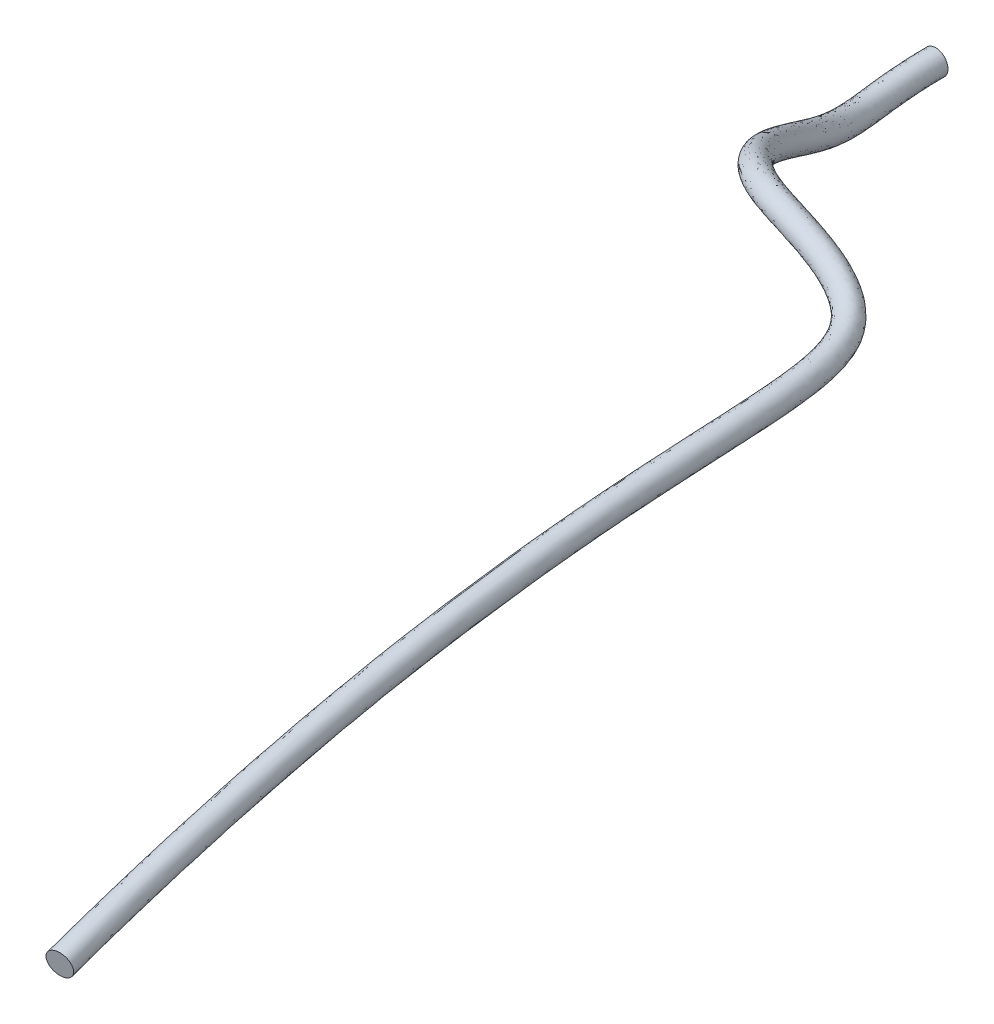
ISO-10303-21;
HEADER;
FILE_DESCRIPTION(('STEP AP214'),'2;1');
FILE_NAME('part.step','',(''),(''),'','','');
FILE_SCHEMA(('AUTOMOTIVE_DESIGN { 1 0 10303 214 1 1 1 1 }'));
ENDSEC;
DATA;
#1=APPLICATION_CONTEXT('core data for automotive mechanical design processes');
#2=APPLICATION_PROTOCOL_DEFINITION('international standard','automotive_design',2000,#1);
#3=PRODUCT_CONTEXT('',#1,'mechanical');
#4=PRODUCT('Part','Part','',(#3));
#5=PRODUCT_RELATED_PRODUCT_CATEGORY('part','',(#4));
#6=PRODUCT_DEFINITION_FORMATION('','',#4);
#7=PRODUCT_DEFINITION_CONTEXT('part definition',#1,'design');
#8=PRODUCT_DEFINITION('design','',#6,#7);
#9=PRODUCT_DEFINITION_SHAPE('','',#8);
#10=(LENGTH_UNIT() NAMED_UNIT(*) SI_UNIT(.MILLI.,.METRE.));
#11=(NAMED_UNIT(*) PLANE_ANGLE_UNIT() SI_UNIT($,.RADIAN.));
#12=(NAMED_UNIT(*) SI_UNIT($,.STERADIAN.) SOLID_ANGLE_UNIT());
#13=UNCERTAINTY_MEASURE_WITH_UNIT(LENGTH_MEASURE(1.E-05),#10,'distance_accuracy_value','');
#14=(GEOMETRIC_REPRESENTATION_CONTEXT(3) GLOBAL_UNCERTAINTY_ASSIGNED_CONTEXT((#13)) GLOBAL_UNIT_ASSIGNED_CONTEXT((#10,
#11,#12)) REPRESENTATION_CONTEXT('',''));
#15=CARTESIAN_POINT('',(0.,0.,0.));
#16=DIRECTION('',(0.,0.,1.));
#17=DIRECTION('',(1.,0.,0.));
#18=AXIS2_PLACEMENT_3D('',#15,#16,#17);
#19=CARTESIAN_POINT('',(0.,0.,0.));
#20=DIRECTION('',(0.,0.,1.));
#21=DIRECTION('',(-1.,0.,0.));
#22=AXIS2_PLACEMENT_3D('',#19,#20,#21);
#23=PLANE('',#22);
#24=CARTESIAN_POINT('',(0.,0.,0.));
#25=DIRECTION('',(0.,0.,-1.));
#26=DIRECTION('',(-1.,0.,0.));
#27=AXIS2_PLACEMENT_3D('',#24,#25,#26);
#28=CIRCLE('',#27,1.15);
#29=CARTESIAN_POINT('',(-1.15,0.,0.));
#30=VERTEX_POINT('',#29);
#31=EDGE_CURVE('E42',#30,#30,#28,.T.);
#32=ORIENTED_EDGE('',*,*,#31,.T.);
#33=EDGE_LOOP('',(#32));
#34=FACE_BOUND('',#33,.T.);
#35=ADVANCED_FACE('F35',(#34),#23,.F.);
#36=CARTESIAN_POINT('',(31.9988546699459,-0.115057870125923,113.901531639743));
#37=DIRECTION('',(0.116187071582963,-0.188366381532385,0.975201861516564));
#38=DIRECTION('',(-0.882578906659321,0.430783948462864,0.188360460996416));
#39=AXIS2_PLACEMENT_3D('',#36,#37,#38);
#40=PLANE('',#39);
#41=CARTESIAN_POINT('',(31.9988546699459,-0.115057870125923,113.901531639743));
#42=DIRECTION('',(-0.116187071582963,0.188366381532385,-0.975201861516564));
#43=DIRECTION('',(-0.882578906659321,0.430783948462864,0.188360460996416));
#44=AXIS2_PLACEMENT_3D('',#41,#42,#43);
#45=CIRCLE('',#44,1.15);
#46=CARTESIAN_POINT('',(30.9838889272877,0.380343670606371,114.118146169889));
#47=VERTEX_POINT('',#46);
#48=EDGE_CURVE('E11',#47,#47,#45,.T.);
#49=ORIENTED_EDGE('',*,*,#48,.F.);
#50=EDGE_LOOP('',(#49));
#51=FACE_BOUND('',#50,.T.);
#52=ADVANCED_FACE('F52',(#51),#40,.T.);
#53=CARTESIAN_POINT('',(-1.15,0.,0.));
#54=CARTESIAN_POINT('',(-1.15000000038601,-2.13450483906938E-09,1.40411667395807));
#55=CARTESIAN_POINT('',(-1.12163524752858,-0.0455836005803812,2.60482889908168));
#56=CARTESIAN_POINT('',(-0.986712418979958,-0.113027990204314,4.78907536466526));
#57=CARTESIAN_POINT('',(-0.879728619676994,-0.134648475537359,5.7730653348689));
#58=CARTESIAN_POINT('',(-0.568027062855145,-0.0331756014267641,7.69206339895828));
#59=CARTESIAN_POINT('',(-0.363677743166363,0.0904033964046519,8.62505191253891));
#60=CARTESIAN_POINT('',(0.152012278636615,0.590608892697884,10.6057794772086));
#61=CARTESIAN_POINT('',(0.463093220859393,0.966286046148688,11.6542177741515));
#62=CARTESIAN_POINT('',(1.23067961718823,2.10810592887332,14.1307295042907));
#63=CARTESIAN_POINT('',(1.70106778904385,2.90554702535931,15.5986453352897));
#64=CARTESIAN_POINT('',(2.87977037735416,4.65910869199436,18.6634669361827));
#65=CARTESIAN_POINT('',(3.58782366157497,5.61542282336658,20.2611964574223));
#66=CARTESIAN_POINT('',(5.34397098013944,7.42814134988539,23.341725362619));
#67=CARTESIAN_POINT('',(6.39135817160007,8.28592389525016,24.826096657326));
#68=CARTESIAN_POINT('',(8.96395449019275,9.62991514462926,27.4300799785647));
#69=CARTESIAN_POINT('',(10.4988908724992,10.116532799519,28.5531699516577));
#70=CARTESIAN_POINT('',(13.4859288705706,10.3293225152492,29.8086869101349));
#71=CARTESIAN_POINT('',(14.7038374575679,10.2647728885911,30.1301939321772));
#72=CARTESIAN_POINT('',(17.1080159363378,9.98807206024214,30.6946383333805));
#73=CARTESIAN_POINT('',(18.2972584427251,9.77482488645506,30.9371166704468));
#74=CARTESIAN_POINT('',(20.5116837808707,9.31698374742247,31.5411573325904));
#75=CARTESIAN_POINT('',(21.5337661848834,9.07308699833395,31.9030588566672));
#76=CARTESIAN_POINT('',(23.2756001008974,8.6585260336751,32.8855085253722));
#77=CARTESIAN_POINT('',(23.9936903641095,8.48767638839588,33.4939028373493));
#78=CARTESIAN_POINT('',(25.0599004134921,8.2899836962635,35.0634181827539));
#79=CARTESIAN_POINT('',(25.4693113590438,8.24422196176755,36.0223406291999));
#80=CARTESIAN_POINT('',(26.1185893059203,8.20545707272597,38.5179378443045));
#81=CARTESIAN_POINT('',(26.3560213637961,8.21222116051957,40.0475269213535));
#82=CARTESIAN_POINT('',(26.8751396639413,8.21775674957013,45.5430804921333));
#83=CARTESIAN_POINT('',(26.9657264633824,8.20028290662248,50.408839272597));
#84=CARTESIAN_POINT('',(27.3729455839668,7.27188284521443,69.3238046121954));
#85=CARTESIAN_POINT('',(27.8360372497974,5.48374650240939,87.6970411872361));
#86=CARTESIAN_POINT('',(30.9838889272877,0.380343670606371,114.118146169889));
#87=CARTESIAN_POINT('',(-1.15,2.3,0.));
#88=CARTESIAN_POINT('',(-1.15000000030546,2.29999999774325,1.45368024150767));
#89=CARTESIAN_POINT('',(-1.11987976196573,2.25294228848605,2.68805822045673));
#90=CARTESIAN_POINT('',(-0.986420047690538,2.18625649869582,4.84774577741702));
#91=CARTESIAN_POINT('',(-0.883576622576509,2.16820796010899,5.76853067253322));
#92=CARTESIAN_POINT('',(-0.608428063087534,2.25772458245462,7.46113650123156));
#93=CARTESIAN_POINT('',(-0.437977823083596,2.36118671279866,8.23531581140845));
#94=CARTESIAN_POINT('',(0.00211678953055316,2.78803495884321,9.92554302700057));
#95=CARTESIAN_POINT('',(0.274570393020001,3.11422663306356,10.8463970004701));
#96=CARTESIAN_POINT('',(0.981777659885264,4.16622996929226,13.1281041987432));
#97=CARTESIAN_POINT('',(1.43935903607286,4.9412945142335,14.5605225115562));
#98=CARTESIAN_POINT('',(2.60448621627325,6.67468788250677,17.5900995877514));
#99=CARTESIAN_POINT('',(3.31280242729696,7.633746817924,19.1927513443077));
#100=CARTESIAN_POINT('',(5.09452633691307,9.47290804351192,22.3182264987289));
#101=CARTESIAN_POINT('',(6.16660839375214,10.3557010299729,23.8444193667923));
#102=CARTESIAN_POINT('',(8.85853032191823,11.7620429033973,26.5692100020356));
#103=CARTESIAN_POINT('',(10.4960041206883,12.2868118934972,27.7747524637937));
#104=CARTESIAN_POINT('',(13.7263126211921,12.5169317982091,29.1325217252641));
#105=CARTESIAN_POINT('',(15.0291921096376,12.4467992383082,29.4753662131319));
#106=CARTESIAN_POINT('',(17.5818598469435,12.1531165581351,30.0750027523357));
#107=CARTESIAN_POINT('',(18.8365245732711,11.9279707551851,30.3307422044092));
#108=CARTESIAN_POINT('',(21.1783321220974,11.4438681481626,30.9697749564959));
#109=CARTESIAN_POINT('',(22.2633808943536,11.1850345188788,31.3531808838988));
#110=CARTESIAN_POINT('',(24.126103982831,10.7417290484125,32.4039131715725));
#111=CARTESIAN_POINT('',(24.90066171508,10.5576505789655,33.0619584960508));
#112=CARTESIAN_POINT('',(26.0328779783983,10.3477192214095,34.7286381493729));
#113=CARTESIAN_POINT('',(26.4640061256414,10.2997468696394,35.7431113796272));
#114=CARTESIAN_POINT('',(27.1388293817799,10.2594456844529,38.3368017901375));
#115=CARTESIAN_POINT('',(27.3819316656735,10.266508768431,39.9101502164698));
#116=CARTESIAN_POINT('',(27.9118640086,10.2721453858816,45.5198965613145));
#117=CARTESIAN_POINT('',(28.0021915647737,10.2537706671499,50.4412096727091));
#118=CARTESIAN_POINT('',(28.4123804129625,9.31860072919853,69.4940986726683));
#119=CARTESIAN_POINT('',(28.8788370977383,7.52184439971334,87.9219997042581));
#120=CARTESIAN_POINT('',(32.0317277271901,2.41027224967798,114.385398509986));
#121=CARTESIAN_POINT('',(1.15,2.3,0.));
#122=CARTESIAN_POINT('',(1.14999999976228,2.29999999763094,1.42258713504903));
#123=CARTESIAN_POINT('',(1.17970589648002,2.25434102356367,2.61042186531614));
#124=CARTESIAN_POINT('',(1.30525120934955,2.19155921748981,4.64198307377375));
#125=CARTESIAN_POINT('',(1.39974312497445,2.17553530030015,5.48027338419586));
#126=CARTESIAN_POINT('',(1.6486922784187,2.25631467082705,7.01158027537886));
#127=CARTESIAN_POINT('',(1.80203149315792,2.34804362400613,7.71099434866211));
#128=CARTESIAN_POINT('',(2.21656341809784,2.7500607545698,9.30303875838792));
#129=CARTESIAN_POINT('',(2.48108487472946,3.06505316070779,10.1990766371529));
#130=CARTESIAN_POINT('',(3.18152342451672,4.10698784776783,12.458945492119));
#131=CARTESIAN_POINT('',(3.62705355978731,4.86170684108259,13.8514651436541));
#132=CARTESIAN_POINT('',(4.74693643370806,6.52781002079589,16.7633965960215));
#133=CARTESIAN_POINT('',(5.42258183838367,7.43953721226092,18.2866539015238));
#134=CARTESIAN_POINT('',(7.07988969663745,9.15031377610454,21.1938758521855));
#135=CARTESIAN_POINT('',(8.06164018903877,9.9492975607313,22.5780661619679));
#136=CARTESIAN_POINT('',(10.4045585759612,11.1733275603611,24.9495894913944));
#137=CARTESIAN_POINT('',(11.7639058857457,11.5987759903035,25.9369113233506));
#138=CARTESIAN_POINT('',(14.3753118205452,11.7848070527038,27.034542263));
#139=CARTESIAN_POINT('',(15.5233210022874,11.7311522374743,27.3448416877877));
#140=CARTESIAN_POINT('',(17.9332170813006,11.454221283658,27.9108534413569));
#141=CARTESIAN_POINT('',(19.1940352466503,11.2315413926317,28.1664312271909));
#142=CARTESIAN_POINT('',(21.695012914061,10.7147866916185,28.8487961901196));
#143=CARTESIAN_POINT('',(22.9392792432824,10.4194406078466,29.2750175652025));
#144=CARTESIAN_POINT('',(25.2588954498099,9.8674970697488,30.5834084867944));
#145=CARTESIAN_POINT('',(26.3344512604499,9.61166383212488,31.4806046311639));
#146=CARTESIAN_POINT('',(27.8876377421588,9.32367760513961,33.7669739296408));
#147=CARTESIAN_POINT('',(28.4039954454789,9.26958999665599,35.0381210714887));
#148=CARTESIAN_POINT('',(29.1685865027609,9.22390294809337,37.9768985263314));
#149=CARTESIAN_POINT('',(29.4210969120536,9.23216094661085,39.6528314587336));
#150=CARTESIAN_POINT('',(29.9694797193934,9.23796673080044,45.4580488007992));
#151=CARTESIAN_POINT('',(30.0549188251068,9.21812804136961,50.3739499725997));
#152=CARTESIAN_POINT('',(30.4633193269557,8.28703445995778,69.3437807201011));
#153=CARTESIAN_POINT('',(30.9237518635325,6.50674992121863,87.6145309589596));
#154=CARTESIAN_POINT('',(34.0616592125065,1.4194691682134,113.952169449695));
#155=CARTESIAN_POINT('',(1.15,0.,0.));
#156=CARTESIAN_POINT('',(1.14999999968174,-2.24681575311621E-09,1.37302356749943));
#157=CARTESIAN_POINT('',(1.17795041091717,-0.0441848655027606,2.52719254394097));
#158=CARTESIAN_POINT('',(1.30495883806013,-0.107725271410329,4.5833126610221));
#159=CARTESIAN_POINT('',(1.40359112787397,-0.127321135346196,5.48480804653155));
#160=CARTESIAN_POINT('',(1.68909327865109,-0.0345855130543298,7.24250717310558));
#161=CARTESIAN_POINT('',(1.87633157307504,0.0772603076121273,8.10073044979258));
#162=CARTESIAN_POINT('',(2.36645890720402,0.552634688424476,9.98327520859595));
#163=CARTESIAN_POINT('',(2.66960770256885,0.917112573792918,11.0068974108343));
#164=CARTESIAN_POINT('',(3.43042538181969,2.04886380734889,13.4615707976665));
#165=CARTESIAN_POINT('',(3.8887623127581,2.82595935220841,14.8895879673877));
#166=CARTESIAN_POINT('',(5.02222059478917,4.51223083028349,17.8367639444527));
#167=CARTESIAN_POINT('',(5.69760307266126,5.4212132177035,19.3550990146384));
#168=CARTESIAN_POINT('',(7.32933433986423,7.105547082478,22.2173747160756));
#169=CARTESIAN_POINT('',(8.2863899668867,7.87952042600776,23.5597434525015));
#170=CARTESIAN_POINT('',(10.5099827442357,9.04119980159387,25.8104594679235));
#171=CARTESIAN_POINT('',(11.7667926375566,9.42849689632489,26.7153288112146));
#172=CARTESIAN_POINT('',(14.1349280699237,9.59719776974419,27.7107074478708));
#173=CARTESIAN_POINT('',(15.1979663502177,9.54912588775689,27.999669406833));
#174=CARTESIAN_POINT('',(17.4593731706948,9.28917678576533,28.5304890224018));
#175=CARTESIAN_POINT('',(18.6547691161043,9.07839552390139,28.7728056932284));
#176=CARTESIAN_POINT('',(21.0283645728343,8.5879022908787,29.4201785662141));
#177=CARTESIAN_POINT('',(22.2096645338132,8.3074930873013,29.8248955379709));
#178=CARTESIAN_POINT('',(24.4083915678753,7.78429405501193,31.0650038405941));
#179=CARTESIAN_POINT('',(25.4274799094794,7.54168964155526,31.9125489724624));
#180=CARTESIAN_POINT('',(26.9146601772527,7.26594207999361,34.1017539630218));
#181=CARTESIAN_POINT('',(27.4093006788813,7.21406508878416,35.317350321059));
#182=CARTESIAN_POINT('',(28.1483464269014,7.16991433636647,38.1580345805007));
#183=CARTESIAN_POINT('',(28.3951866101762,7.17787333869983,39.7902081636173));
#184=CARTESIAN_POINT('',(28.9327553747348,7.18357809448817,45.4812327316181));
#185=CARTESIAN_POINT('',(29.0184537237155,7.16464028084216,50.3415795724876));
#186=CARTESIAN_POINT('',(29.4238844979599,6.24031657597368,69.1734866596282));
#187=CARTESIAN_POINT('',(29.8809520155213,4.46865202391176,87.3895724419376));
#188=CARTESIAN_POINT('',(33.0138204126041,-0.610459410858216,113.684917109598));
#189=CARTESIAN_POINT('',(1.15,-2.3,0.));
#190=CARTESIAN_POINT('',(1.1499999996012,-2.30000000212457,1.32345999994982));
#191=CARTESIAN_POINT('',(1.17619492535432,-2.34271075456919,2.44396322256579));
#192=CARTESIAN_POINT('',(1.30466646677071,-2.40700976031047,4.52464224827045));
#193=CARTESIAN_POINT('',(1.40743913077348,-2.43017757099254,5.48934270886723));
#194=CARTESIAN_POINT('',(1.72949427888348,-2.32548569693571,7.4734340708323));
#195=CARTESIAN_POINT('',(1.95063165299217,-2.19352300878188,8.49046655092304));
#196=CARTESIAN_POINT('',(2.51635439631019,-1.64479137772085,10.663511658804));
#197=CARTESIAN_POINT('',(2.85813053040824,-1.23082801312195,11.8147181845157));
#198=CARTESIAN_POINT('',(3.67932733912265,-0.00926023307004371,14.464196103214));
#199=CARTESIAN_POINT('',(4.1504710657289,0.79021186333422,15.9277107911212));
#200=CARTESIAN_POINT('',(5.29750475587028,2.49665163977109,18.9101312928839));
#201=CARTESIAN_POINT('',(5.97262430693885,3.40288922314608,20.423544127753));
#202=CARTESIAN_POINT('',(7.57877898309101,5.06078038885147,23.2408735799658));
#203=CARTESIAN_POINT('',(8.51113974473463,5.80974329128423,24.5414207430351));
#204=CARTESIAN_POINT('',(10.6154069125102,6.90907204282665,26.6713294444526));
#205=CARTESIAN_POINT('',(11.7696793893675,7.25821780234626,27.4937462990786));
#206=CARTESIAN_POINT('',(13.8945443193022,7.40958848678453,28.3868726327416));
#207=CARTESIAN_POINT('',(14.8726116981481,7.36709953803954,28.6544971258783));
#208=CARTESIAN_POINT('',(16.9855292600891,7.12413228787265,29.1501246034466));
#209=CARTESIAN_POINT('',(18.1155029855582,6.92524965517112,29.379180159266));
#210=CARTESIAN_POINT('',(20.3617162316076,6.46101789013887,29.9915609423086));
#211=CARTESIAN_POINT('',(21.4800498243439,6.19554556675598,30.3747735107393));
#212=CARTESIAN_POINT('',(23.5578876859408,5.70109104027506,31.5465991943939));
#213=CARTESIAN_POINT('',(24.5205085585089,5.47171545098563,32.344493313761));
#214=CARTESIAN_POINT('',(25.9416826123465,5.20820655484762,34.4365339964028));
#215=CARTESIAN_POINT('',(26.4146059122836,5.15854018091233,35.5965795706293));
#216=CARTESIAN_POINT('',(27.1281063510418,5.11592572463957,38.33917063467));
#217=CARTESIAN_POINT('',(27.3692763082988,5.12358573078881,39.9275848685009));
#218=CARTESIAN_POINT('',(27.8960310300761,5.1291894581759,45.504416662437));
#219=CARTESIAN_POINT('',(27.9819886223242,5.11115252031472,50.3092091723756));
#220=CARTESIAN_POINT('',(28.3844496689642,4.19359869198958,69.0031925991553));
#221=CARTESIAN_POINT('',(28.83815216751,2.43055412660488,87.1646139249157));
#222=CARTESIAN_POINT('',(31.9659816127017,-2.64038798992983,113.417664769501));
#223=CARTESIAN_POINT('',(-1.15,-2.3,0.));
#224=CARTESIAN_POINT('',(-1.15000000046655,-2.30000000201226,1.35455310640847));
#225=CARTESIAN_POINT('',(-1.12339073309142,-2.34410948964681,2.52159957770662));
#226=CARTESIAN_POINT('',(-0.987004790269378,-2.41231247910445,4.73040495191349));
#227=CARTESIAN_POINT('',(-0.875880616777478,-2.4375049111837,5.77759999720459));
#228=CARTESIAN_POINT('',(-0.527626062622756,-2.32407578530815,7.92299029668499));
#229=CARTESIAN_POINT('',(-0.28937766324913,-2.18037991998935,9.01478801366938));
#230=CARTESIAN_POINT('',(0.301907767742677,-1.60681717344744,11.2860159274166));
#231=CARTESIAN_POINT('',(0.651616048698785,-1.18165454076618,12.4620385478329));
#232=CARTESIAN_POINT('',(1.4795815744912,0.0499818884543864,15.1333548098382));
#233=CARTESIAN_POINT('',(1.96277654201484,0.869799536485127,16.6367681590233));
#234=CARTESIAN_POINT('',(3.15505453843507,2.64352950148196,19.7368342846139));
#235=CARTESIAN_POINT('',(3.86284489585297,3.59709882880916,21.3296415705369));
#236=CARTESIAN_POINT('',(5.5934156233658,5.38337465625885,24.3652242265092));
#237=CARTESIAN_POINT('',(6.616107949448,6.21614676052742,25.8077739478596));
#238=CARTESIAN_POINT('',(9.06937865846727,7.49778738586125,28.2909499550939));
#239=CARTESIAN_POINT('',(10.5017776243101,7.94625370554071,29.3315874395217));
#240=CARTESIAN_POINT('',(13.2455451199491,8.14171323228929,30.4848520950057));
#241=CARTESIAN_POINT('',(14.3784828054983,8.08274653887403,30.7850216512225));
#242=CARTESIAN_POINT('',(16.634172025732,7.8230275623492,31.3142739144254));
#243=CARTESIAN_POINT('',(17.7579923121791,7.62167901772506,31.5434911364844));
#244=CARTESIAN_POINT('',(19.845035439644,7.19009934668239,32.1125397086849));
#245=CARTESIAN_POINT('',(20.8041514754131,6.96113947778913,32.4529368294357));
#246=CARTESIAN_POINT('',(22.4250962189639,6.57532301893773,33.367103879172));
#247=CARTESIAN_POINT('',(23.086719013139,6.41770219782626,33.9258471786479));
#248=CARTESIAN_POINT('',(24.086922848586,6.23224817111751,35.3981982161348));
#249=CARTESIAN_POINT('',(24.4746165924461,6.18869705389573,36.3015698787726));
#250=CARTESIAN_POINT('',(25.0983492300608,6.15146846099907,38.6990738984714));
#251=CARTESIAN_POINT('',(25.3301110619188,6.15793355260815,40.1849036262371));
#252=CARTESIAN_POINT('',(25.8384153192827,6.16336811325867,45.5662644229522));
#253=CARTESIAN_POINT('',(25.929261361991,6.14679514609503,50.3764688724849));
#254=CARTESIAN_POINT('',(26.3335107549711,5.22516496123034,69.1535105517225));
#255=CARTESIAN_POINT('',(26.7932374018566,3.44564860510545,87.4720826702142));
#256=CARTESIAN_POINT('',(29.9360501273852,-1.64958490846524,113.850893829792));
#257=CARTESIAN_POINT('',(-1.15,0.,0.));
#258=CARTESIAN_POINT('',(-1.15000000038601,-2.13450483906938E-09,1.40411667395807));
#259=CARTESIAN_POINT('',(-1.12163524752858,-0.0455836005803812,2.60482889908168));
#260=CARTESIAN_POINT('',(-0.986712418979958,-0.113027990204314,4.78907536466526));
#261=CARTESIAN_POINT('',(-0.879728619676994,-0.134648475537359,5.7730653348689));
#262=CARTESIAN_POINT('',(-0.568027062855145,-0.0331756014267641,7.69206339895828));
#263=CARTESIAN_POINT('',(-0.363677743166363,0.0904033964046519,8.62505191253891));
#264=CARTESIAN_POINT('',(0.152012278636615,0.590608892697884,10.6057794772086));
#265=CARTESIAN_POINT('',(0.463093220859393,0.966286046148688,11.6542177741515));
#266=CARTESIAN_POINT('',(1.23067961718823,2.10810592887332,14.1307295042907));
#267=CARTESIAN_POINT('',(1.70106778904385,2.90554702535931,15.5986453352897));
#268=CARTESIAN_POINT('',(2.87977037735416,4.65910869199436,18.6634669361827));
#269=CARTESIAN_POINT('',(3.58782366157497,5.61542282336658,20.2611964574223));
#270=CARTESIAN_POINT('',(5.34397098013944,7.42814134988539,23.341725362619));
#271=CARTESIAN_POINT('',(6.39135817160007,8.28592389525016,24.826096657326));
#272=CARTESIAN_POINT('',(8.96395449019275,9.62991514462926,27.4300799785647));
#273=CARTESIAN_POINT('',(10.4988908724992,10.116532799519,28.5531699516577));
#274=CARTESIAN_POINT('',(13.4859288705706,10.3293225152492,29.8086869101349));
#275=CARTESIAN_POINT('',(14.7038374575679,10.2647728885911,30.1301939321772));
#276=CARTESIAN_POINT('',(17.1080159363378,9.98807206024214,30.6946383333805));
#277=CARTESIAN_POINT('',(18.2972584427251,9.77482488645506,30.9371166704468));
#278=CARTESIAN_POINT('',(20.5116837808707,9.31698374742247,31.5411573325904));
#279=CARTESIAN_POINT('',(21.5337661848834,9.07308699833395,31.9030588566672));
#280=CARTESIAN_POINT('',(23.2756001008974,8.6585260336751,32.8855085253722));
#281=CARTESIAN_POINT('',(23.9936903641095,8.48767638839588,33.4939028373493));
#282=CARTESIAN_POINT('',(25.0599004134921,8.2899836962635,35.0634181827539));
#283=CARTESIAN_POINT('',(25.4693113590438,8.24422196176755,36.0223406291999));
#284=CARTESIAN_POINT('',(26.1185893059203,8.20545707272597,38.5179378443045));
#285=CARTESIAN_POINT('',(26.3560213637961,8.21222116051957,40.0475269213535));
#286=CARTESIAN_POINT('',(26.8751396639413,8.21775674957013,45.5430804921333));
#287=CARTESIAN_POINT('',(26.9657264633824,8.20028290662248,50.408839272597));
#288=CARTESIAN_POINT('',(27.3729455839668,7.27188284521443,69.3238046121954));
#289=CARTESIAN_POINT('',(27.8360372497974,5.48374650240939,87.6970411872361));
#290=CARTESIAN_POINT('',(30.9838889272877,0.380343670606371,114.118146169889));
#291=(BOUNDED_SURFACE() B_SPLINE_SURFACE(3,3,((#53,#54,#55,#56,#57,#58,#59,#60,#61,#62,#63,#64,
#65,#66,#67,#68,#69,#70,#71,#72,#73,#74,#75,#76,#77,#78,#79,#80,#81,#82,#83,#84,#85,#86),(#87,
#88,#89,#90,#91,#92,#93,#94,#95,#96,#97,#98,#99,#100,#101,#102,#103,#104,#105,#106,#107,#108,
#109,#110,#111,#112,#113,#114,#115,#116,#117,#118,#119,#120),(#121,#122,#123,#124,#125,#126,
#127,#128,#129,#130,#131,#132,#133,#134,#135,#136,#137,#138,#139,#140,#141,#142,#143,#144,#145,
#146,#147,#148,#149,#150,#151,#152,#153,#154),(#155,#156,#157,#158,#159,#160,#161,#162,#163,
#164,#165,#166,#167,#168,#169,#170,#171,#172,#173,#174,#175,#176,#177,#178,#179,#180,#181,#182,
#183,#184,#185,#186,#187,#188),(#189,#190,#191,#192,#193,#194,#195,#196,#197,#198,#199,#200,
#201,#202,#203,#204,#205,#206,#207,#208,#209,#210,#211,#212,#213,#214,#215,#216,#217,#218,#219,
#220,#221,#222),(#223,#224,#225,#226,#227,#228,#229,#230,#231,#232,#233,#234,#235,#236,#237,
#238,#239,#240,#241,#242,#243,#244,#245,#246,#247,#248,#249,#250,#251,#252,#253,#254,#255,#256),
(#257,#258,#259,#260,#261,#262,#263,#264,#265,#266,#267,#268,#269,#270,#271,#272,#273,#274,#275,
#276,#277,#278,#279,#280,#281,#282,#283,#284,#285,#286,#287,#288,#289,#290)),.UNSPECIFIED.,.T.,
.F.,.F.) B_SPLINE_SURFACE_WITH_KNOTS((4,3,4),(4,2,2,2,2,2,2,2,2,2,2,2,2,2,2,2,4),(0.,0.5,1.),
(0.,0.0639961778010472,0.127992355602094,0.191988533403142,0.255984711204189,0.323476430323547,
0.390968149442906,0.458459868562264,0.525951587681623,0.569038039796595,0.612124491911568,
0.65521094402654,0.698297396141513,0.736010221623824,0.773723047106135,0.849148698070757,1.),
.UNSPECIFIED.) GEOMETRIC_REPRESENTATION_ITEM() RATIONAL_B_SPLINE_SURFACE(((1.,1.,1.,1.,1.,1.,1.,
1.,1.,1.,1.,1.,1.,1.,1.,1.,1.,1.,1.,1.,1.,1.,1.,1.,1.,1.,1.,1.,1.,1.,1.,1.,1.,1.),
(0.333333333333333,0.333333333333333,0.333333333333333,0.333333333333333,0.333333333333333,
0.333333333333333,0.333333333333333,0.333333333333333,0.333333333333333,0.333333333333333,
0.333333333333333,0.333333333333333,0.333333333333333,0.333333333333333,0.333333333333333,
0.333333333333333,0.333333333333333,0.333333333333333,0.333333333333333,0.333333333333333,
0.333333333333333,0.333333333333333,0.333333333333333,0.333333333333333,0.333333333333333,
0.333333333333333,0.333333333333333,0.333333333333333,0.333333333333333,0.333333333333333,
0.333333333333333,0.333333333333333,0.333333333333333,0.333333333333333),(0.333333333333333,
0.333333333333333,0.333333333333333,0.333333333333333,0.333333333333333,0.333333333333333,
0.333333333333333,0.333333333333333,0.333333333333333,0.333333333333333,0.333333333333333,
0.333333333333333,0.333333333333333,0.333333333333333,0.333333333333333,0.333333333333333,
0.333333333333333,0.333333333333333,0.333333333333333,0.333333333333333,0.333333333333333,
0.333333333333333,0.333333333333333,0.333333333333333,0.333333333333333,0.333333333333333,
0.333333333333333,0.333333333333333,0.333333333333333,0.333333333333333,0.333333333333333,
0.333333333333333,0.333333333333333,0.333333333333333),(1.,1.,1.,1.,1.,1.,1.,1.,1.,1.,1.,1.,1.,
1.,1.,1.,1.,1.,1.,1.,1.,1.,1.,1.,1.,1.,1.,1.,1.,1.,1.,1.,1.,1.),(0.333333333333333,
0.333333333333333,0.333333333333333,0.333333333333333,0.333333333333333,0.333333333333333,
0.333333333333333,0.333333333333333,0.333333333333333,0.333333333333333,0.333333333333333,
0.333333333333333,0.333333333333333,0.333333333333333,0.333333333333333,0.333333333333333,
0.333333333333333,0.333333333333333,0.333333333333333,0.333333333333333,0.333333333333333,
0.333333333333333,0.333333333333333,0.333333333333333,0.333333333333333,0.333333333333333,
0.333333333333333,0.333333333333333,0.333333333333333,0.333333333333333,0.333333333333333,
0.333333333333333,0.333333333333333,0.333333333333333),(0.333333333333333,0.333333333333333,
0.333333333333333,0.333333333333333,0.333333333333333,0.333333333333333,0.333333333333333,
0.333333333333333,0.333333333333333,0.333333333333333,0.333333333333333,0.333333333333333,
0.333333333333333,0.333333333333333,0.333333333333333,0.333333333333333,0.333333333333333,
0.333333333333333,0.333333333333333,0.333333333333333,0.333333333333333,0.333333333333333,
0.333333333333333,0.333333333333333,0.333333333333333,0.333333333333333,0.333333333333333,
0.333333333333333,0.333333333333333,0.333333333333333,0.333333333333333,0.333333333333333,
0.333333333333333,0.333333333333333),(1.,1.,1.,1.,1.,1.,1.,1.,1.,1.,1.,1.,1.,1.,1.,1.,1.,1.,1.,
1.,1.,1.,1.,1.,1.,1.,1.,1.,1.,1.,1.,1.,1.,1.))) REPRESENTATION_ITEM('') SURFACE());
#292=ORIENTED_EDGE('',*,*,#48,.T.);
#293=EDGE_LOOP('',(#292));
#294=FACE_BOUND('',#293,.T.);
#295=ORIENTED_EDGE('',*,*,#31,.F.);
#296=EDGE_LOOP('',(#295));
#297=FACE_BOUND('',#296,.T.);
#298=ADVANCED_FACE('F49',(#294,#297),#291,.F.);
#299=CLOSED_SHELL('',(#35,#52,#298));
#300=MANIFOLD_SOLID_BREP('B2',#299);
#301=ADVANCED_BREP_SHAPE_REPRESENTATION('',(#18,#300),#14);
#302=SHAPE_DEFINITION_REPRESENTATION(#9,#301);
ENDSEC;
END-ISO-10303-21;
